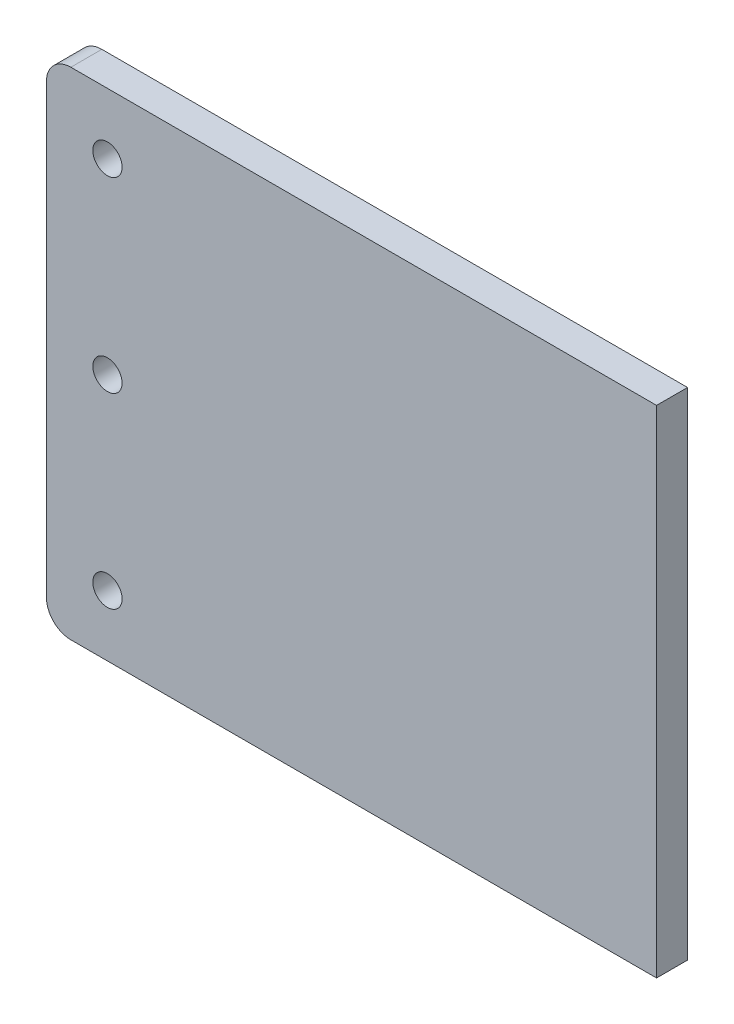
ISO-10303-21;
HEADER;
FILE_DESCRIPTION(('STEP AP214'),'2;1');
FILE_NAME('part.step','',(''),(''),'','','');
FILE_SCHEMA(('AUTOMOTIVE_DESIGN { 1 0 10303 214 1 1 1 1 }'));
ENDSEC;
DATA;
#1=APPLICATION_CONTEXT('core data for automotive mechanical design processes');
#2=APPLICATION_PROTOCOL_DEFINITION('international standard','automotive_design',2000,#1);
#3=PRODUCT_CONTEXT('',#1,'mechanical');
#4=PRODUCT('Part','Part','',(#3));
#5=PRODUCT_RELATED_PRODUCT_CATEGORY('part','',(#4));
#6=PRODUCT_DEFINITION_FORMATION('','',#4);
#7=PRODUCT_DEFINITION_CONTEXT('part definition',#1,'design');
#8=PRODUCT_DEFINITION('design','',#6,#7);
#9=PRODUCT_DEFINITION_SHAPE('','',#8);
#10=(LENGTH_UNIT() NAMED_UNIT(*) SI_UNIT(.MILLI.,.METRE.));
#11=(NAMED_UNIT(*) PLANE_ANGLE_UNIT() SI_UNIT($,.RADIAN.));
#12=(NAMED_UNIT(*) SI_UNIT($,.STERADIAN.) SOLID_ANGLE_UNIT());
#13=UNCERTAINTY_MEASURE_WITH_UNIT(LENGTH_MEASURE(1.E-05),#10,'distance_accuracy_value','');
#14=(GEOMETRIC_REPRESENTATION_CONTEXT(3) GLOBAL_UNCERTAINTY_ASSIGNED_CONTEXT((#13)) GLOBAL_UNIT_ASSIGNED_CONTEXT((#10,
#11,#12)) REPRESENTATION_CONTEXT('',''));
#15=CARTESIAN_POINT('',(0.,0.,0.));
#16=DIRECTION('',(0.,0.,1.));
#17=DIRECTION('',(1.,0.,0.));
#18=AXIS2_PLACEMENT_3D('',#15,#16,#17);
#19=CARTESIAN_POINT('',(50.01,203.6,-127.004202423773));
#20=DIRECTION('',(0.,0.,-1.));
#21=DIRECTION('',(1.,0.,0.));
#22=AXIS2_PLACEMENT_3D('',#19,#20,#21);
#23=PLANE('',#22);
#24=DIRECTION('',(-1.,0.,0.));
#25=VECTOR('',#24,1.);
#26=CARTESIAN_POINT('',(50.01,102.,-127.004202423773));
#27=LINE('',#26,#25);
#28=CARTESIAN_POINT('',(50.,102.,-127.004202423773));
#29=VERTEX_POINT('',#28);
#30=CARTESIAN_POINT('',(-70.,102.,-127.004202423773));
#31=VERTEX_POINT('',#30);
#32=EDGE_CURVE('E11',#29,#31,#27,.T.);
#33=ORIENTED_EDGE('',*,*,#32,.T.);
#34=CARTESIAN_POINT('',(-70.,107.,-127.004202423773));
#35=DIRECTION('',(0.,0.,-1.));
#36=DIRECTION('',(0.,-1.,0.));
#37=AXIS2_PLACEMENT_3D('',#34,#35,#36);
#38=CIRCLE('',#37,5.);
#39=CARTESIAN_POINT('',(-75.,107.,-127.004202423773));
#40=VERTEX_POINT('',#39);
#41=EDGE_CURVE('E127',#40,#31,#38,.F.);
#42=ORIENTED_EDGE('',*,*,#41,.F.);
#43=DIRECTION('',(0.,1.,0.));
#44=VECTOR('',#43,1.);
#45=CARTESIAN_POINT('',(-75.,203.6,-127.004202423773));
#46=LINE('',#45,#44);
#47=CARTESIAN_POINT('',(-75.,198.6,-127.004202423773));
#48=VERTEX_POINT('',#47);
#49=EDGE_CURVE('E103',#40,#48,#46,.T.);
#50=ORIENTED_EDGE('',*,*,#49,.T.);
#51=CARTESIAN_POINT('',(-70.,198.6,-127.004202423773));
#52=DIRECTION('',(0.,0.,-1.));
#53=DIRECTION('',(0.,-1.,0.));
#54=AXIS2_PLACEMENT_3D('',#51,#52,#53);
#55=CIRCLE('',#54,5.);
#56=CARTESIAN_POINT('',(-70.,203.6,-127.004202423773));
#57=VERTEX_POINT('',#56);
#58=EDGE_CURVE('E130',#57,#48,#55,.F.);
#59=ORIENTED_EDGE('',*,*,#58,.F.);
#60=DIRECTION('',(1.,0.,0.));
#61=VECTOR('',#60,1.);
#62=CARTESIAN_POINT('',(-50.,203.6,-127.004202423773));
#63=LINE('',#62,#61);
#64=CARTESIAN_POINT('',(50.,203.6,-127.004202423773));
#65=VERTEX_POINT('',#64);
#66=EDGE_CURVE('E102',#57,#65,#63,.T.);
#67=ORIENTED_EDGE('',*,*,#66,.T.);
#68=DIRECTION('',(0.,-1.,0.));
#69=VECTOR('',#68,1.);
#70=CARTESIAN_POINT('',(50.,0.,-127.004202423773));
#71=LINE('',#70,#69);
#72=EDGE_CURVE('E38',#65,#29,#71,.T.);
#73=ORIENTED_EDGE('',*,*,#72,.T.);
#74=EDGE_LOOP('',(#33,#42,#50,#59,#67,#73));
#75=FACE_BOUND('',#74,.T.);
#76=CARTESIAN_POINT('',(-62.5,114.5,-127.004202423773));
#77=DIRECTION('',(0.,0.,-1.));
#78=DIRECTION('',(0.,-1.,0.));
#79=AXIS2_PLACEMENT_3D('',#76,#77,#78);
#80=CIRCLE('',#79,3.00000000000001);
#81=CARTESIAN_POINT('',(-62.5,111.5,-127.004202423773));
#82=VERTEX_POINT('',#81);
#83=EDGE_CURVE('E110',#82,#82,#80,.T.);
#84=ORIENTED_EDGE('',*,*,#83,.F.);
#85=EDGE_LOOP('',(#84));
#86=FACE_BOUND('',#85,.T.);
#87=CARTESIAN_POINT('',(-62.5,191.1,-127.004202423773));
#88=DIRECTION('',(0.,0.,-1.));
#89=DIRECTION('',(0.,-1.,0.));
#90=AXIS2_PLACEMENT_3D('',#87,#88,#89);
#91=CIRCLE('',#90,3.00000000000001);
#92=CARTESIAN_POINT('',(-62.5,188.1,-127.004202423773));
#93=VERTEX_POINT('',#92);
#94=EDGE_CURVE('E115',#93,#93,#91,.T.);
#95=ORIENTED_EDGE('',*,*,#94,.F.);
#96=EDGE_LOOP('',(#95));
#97=FACE_BOUND('',#96,.T.);
#98=CARTESIAN_POINT('',(-62.5,152.8,-127.004202423773));
#99=DIRECTION('',(0.,0.,-1.));
#100=DIRECTION('',(0.,-1.,0.));
#101=AXIS2_PLACEMENT_3D('',#98,#99,#100);
#102=CIRCLE('',#101,3.00000000000001);
#103=CARTESIAN_POINT('',(-62.5,149.8,-127.004202423773));
#104=VERTEX_POINT('',#103);
#105=EDGE_CURVE('E107',#104,#104,#102,.T.);
#106=ORIENTED_EDGE('',*,*,#105,.F.);
#107=EDGE_LOOP('',(#106));
#108=FACE_BOUND('',#107,.T.);
#109=ADVANCED_FACE('F34',(#75,#86,#97,#108),#23,.T.);
#110=CARTESIAN_POINT('',(50.01,102.,-38.1042024237733));
#111=DIRECTION('',(0.,-1.,0.));
#112=DIRECTION('',(0.,0.,-1.));
#113=AXIS2_PLACEMENT_3D('',#110,#111,#112);
#114=PLANE('',#113);
#115=DIRECTION('',(0.,0.,1.));
#116=VECTOR('',#115,1.);
#117=CARTESIAN_POINT('',(50.,102.,0.));
#118=LINE('',#117,#116);
#119=CARTESIAN_POINT('',(50.,102.,-120.654202423773));
#120=VERTEX_POINT('',#119);
#121=EDGE_CURVE('E92',#29,#120,#118,.T.);
#122=ORIENTED_EDGE('',*,*,#121,.T.);
#123=DIRECTION('',(1.,0.,0.));
#124=VECTOR('',#123,1.);
#125=CARTESIAN_POINT('',(-75.,102.,-120.654202423773));
#126=LINE('',#125,#124);
#127=CARTESIAN_POINT('',(-70.,102.,-120.654202423773));
#128=VERTEX_POINT('',#127);
#129=EDGE_CURVE('E99',#128,#120,#126,.T.);
#130=ORIENTED_EDGE('',*,*,#129,.F.);
#131=DIRECTION('',(0.,0.,-1.));
#132=VECTOR('',#131,1.);
#133=CARTESIAN_POINT('',(-70.,102.,-120.654202423773));
#134=LINE('',#133,#132);
#135=EDGE_CURVE('E125',#31,#128,#134,.F.);
#136=ORIENTED_EDGE('',*,*,#135,.F.);
#137=ORIENTED_EDGE('',*,*,#32,.F.);
#138=EDGE_LOOP('',(#122,#130,#136,#137));
#139=FACE_BOUND('',#138,.T.);
#140=ADVANCED_FACE('F106',(#139),#114,.T.);
#141=CARTESIAN_POINT('',(50.,0.,0.));
#142=DIRECTION('',(1.,0.,0.));
#143=DIRECTION('',(0.,0.,1.));
#144=AXIS2_PLACEMENT_3D('',#141,#142,#143);
#145=PLANE('',#144);
#146=ORIENTED_EDGE('',*,*,#72,.F.);
#147=DIRECTION('',(0.,0.,1.));
#148=VECTOR('',#147,1.);
#149=CARTESIAN_POINT('',(50.,203.6,-120.654202423773));
#150=LINE('',#149,#148);
#151=CARTESIAN_POINT('',(50.,203.6,-120.654202423773));
#152=VERTEX_POINT('',#151);
#153=EDGE_CURVE('E94',#65,#152,#150,.T.);
#154=ORIENTED_EDGE('',*,*,#153,.T.);
#155=DIRECTION('',(0.,-1.,0.));
#156=VECTOR('',#155,1.);
#157=CARTESIAN_POINT('',(50.,102.,-120.654202423773));
#158=LINE('',#157,#156);
#159=EDGE_CURVE('E89',#152,#120,#158,.T.);
#160=ORIENTED_EDGE('',*,*,#159,.T.);
#161=ORIENTED_EDGE('',*,*,#121,.F.);
#162=EDGE_LOOP('',(#146,#154,#160,#161));
#163=FACE_BOUND('',#162,.T.);
#164=ADVANCED_FACE('F36',(#163),#145,.T.);
#165=CARTESIAN_POINT('',(-75.,0.,0.));
#166=DIRECTION('',(-1.,0.,0.));
#167=DIRECTION('',(0.,0.,-1.));
#168=AXIS2_PLACEMENT_3D('',#165,#166,#167);
#169=PLANE('',#168);
#170=DIRECTION('',(0.,-1.,0.));
#171=VECTOR('',#170,1.);
#172=CARTESIAN_POINT('',(-75.,203.6,-120.654202423773));
#173=LINE('',#172,#171);
#174=CARTESIAN_POINT('',(-75.,198.6,-120.654202423773));
#175=VERTEX_POINT('',#174);
#176=CARTESIAN_POINT('',(-75.,107.,-120.654202423773));
#177=VERTEX_POINT('',#176);
#178=EDGE_CURVE('E143',#175,#177,#173,.T.);
#179=ORIENTED_EDGE('',*,*,#178,.F.);
#180=DIRECTION('',(0.,0.,1.));
#181=VECTOR('',#180,1.);
#182=CARTESIAN_POINT('',(-75.,198.6,-120.654202423773));
#183=LINE('',#182,#181);
#184=EDGE_CURVE('E135',#48,#175,#183,.T.);
#185=ORIENTED_EDGE('',*,*,#184,.F.);
#186=ORIENTED_EDGE('',*,*,#49,.F.);
#187=DIRECTION('',(0.,0.,-1.));
#188=VECTOR('',#187,1.);
#189=CARTESIAN_POINT('',(-75.,107.,-127.004202423773));
#190=LINE('',#189,#188);
#191=EDGE_CURVE('E133',#177,#40,#190,.T.);
#192=ORIENTED_EDGE('',*,*,#191,.F.);
#193=EDGE_LOOP('',(#179,#185,#186,#192));
#194=FACE_BOUND('',#193,.T.);
#195=ADVANCED_FACE('F156',(#194),#169,.T.);
#196=CARTESIAN_POINT('',(-50.,102.,-120.654202423773));
#197=DIRECTION('',(0.,0.,-1.));
#198=DIRECTION('',(1.,0.,0.));
#199=AXIS2_PLACEMENT_3D('',#196,#197,#198);
#200=PLANE('',#199);
#201=CARTESIAN_POINT('',(-62.5,114.5,-120.654202423773));
#202=DIRECTION('',(0.,0.,1.));
#203=DIRECTION('',(1.,0.,0.));
#204=AXIS2_PLACEMENT_3D('',#201,#202,#203);
#205=CIRCLE('',#204,3.00000000000001);
#206=CARTESIAN_POINT('',(-59.5,114.5,-120.654202423773));
#207=VERTEX_POINT('',#206);
#208=EDGE_CURVE('E113',#207,#207,#205,.T.);
#209=ORIENTED_EDGE('',*,*,#208,.F.);
#210=EDGE_LOOP('',(#209));
#211=FACE_BOUND('',#210,.T.);
#212=CARTESIAN_POINT('',(-62.5,191.1,-120.654202423773));
#213=DIRECTION('',(0.,0.,1.));
#214=DIRECTION('',(1.,0.,0.));
#215=AXIS2_PLACEMENT_3D('',#212,#213,#214);
#216=CIRCLE('',#215,3.00000000000001);
#217=CARTESIAN_POINT('',(-59.5,191.1,-120.654202423773));
#218=VERTEX_POINT('',#217);
#219=EDGE_CURVE('E114',#218,#218,#216,.T.);
#220=ORIENTED_EDGE('',*,*,#219,.F.);
#221=EDGE_LOOP('',(#220));
#222=FACE_BOUND('',#221,.T.);
#223=CARTESIAN_POINT('',(-62.5,152.8,-120.654202423773));
#224=DIRECTION('',(0.,0.,1.));
#225=DIRECTION('',(1.,0.,0.));
#226=AXIS2_PLACEMENT_3D('',#223,#224,#225);
#227=CIRCLE('',#226,3.00000000000001);
#228=CARTESIAN_POINT('',(-59.5,152.8,-120.654202423773));
#229=VERTEX_POINT('',#228);
#230=EDGE_CURVE('E118',#229,#229,#227,.T.);
#231=ORIENTED_EDGE('',*,*,#230,.F.);
#232=EDGE_LOOP('',(#231));
#233=FACE_BOUND('',#232,.T.);
#234=ORIENTED_EDGE('',*,*,#129,.T.);
#235=ORIENTED_EDGE('',*,*,#159,.F.);
#236=DIRECTION('',(1.,0.,0.));
#237=VECTOR('',#236,1.);
#238=CARTESIAN_POINT('',(-50.,203.6,-120.654202423773));
#239=LINE('',#238,#237);
#240=CARTESIAN_POINT('',(-70.,203.6,-120.654202423773));
#241=VERTEX_POINT('',#240);
#242=EDGE_CURVE('E96',#241,#152,#239,.T.);
#243=ORIENTED_EDGE('',*,*,#242,.F.);
#244=CARTESIAN_POINT('',(-70.,198.6,-120.654202423773));
#245=DIRECTION('',(0.,0.,1.));
#246=DIRECTION('',(1.,0.,0.));
#247=AXIS2_PLACEMENT_3D('',#244,#245,#246);
#248=CIRCLE('',#247,5.);
#249=EDGE_CURVE('E123',#175,#241,#248,.F.);
#250=ORIENTED_EDGE('',*,*,#249,.F.);
#251=ORIENTED_EDGE('',*,*,#178,.T.);
#252=CARTESIAN_POINT('',(-70.,107.,-120.654202423773));
#253=DIRECTION('',(0.,0.,1.));
#254=DIRECTION('',(1.,0.,0.));
#255=AXIS2_PLACEMENT_3D('',#252,#253,#254);
#256=CIRCLE('',#255,5.);
#257=EDGE_CURVE('E58',#128,#177,#256,.F.);
#258=ORIENTED_EDGE('',*,*,#257,.F.);
#259=EDGE_LOOP('',(#234,#235,#243,#250,#251,#258));
#260=FACE_BOUND('',#259,.T.);
#261=ADVANCED_FACE('F100',(#211,#222,#233,#260),#200,.F.);
#262=CARTESIAN_POINT('',(-62.5,114.5,-143.154202423773));
#263=DIRECTION('',(0.,0.,1.));
#264=DIRECTION('',(-1.,0.,0.));
#265=AXIS2_PLACEMENT_3D('',#262,#263,#264);
#266=CYLINDRICAL_SURFACE('',#265,3.00000000000001);
#267=ORIENTED_EDGE('',*,*,#83,.T.);
#268=EDGE_LOOP('',(#267));
#269=FACE_BOUND('',#268,.T.);
#270=ORIENTED_EDGE('',*,*,#208,.T.);
#271=EDGE_LOOP('',(#270));
#272=FACE_BOUND('',#271,.T.);
#273=ADVANCED_FACE('F155',(#269,#272),#266,.F.);
#274=CARTESIAN_POINT('',(-62.5,191.1,-143.154202423773));
#275=DIRECTION('',(0.,0.,1.));
#276=DIRECTION('',(-1.,0.,0.));
#277=AXIS2_PLACEMENT_3D('',#274,#275,#276);
#278=CYLINDRICAL_SURFACE('',#277,3.00000000000001);
#279=ORIENTED_EDGE('',*,*,#94,.T.);
#280=EDGE_LOOP('',(#279));
#281=FACE_BOUND('',#280,.T.);
#282=ORIENTED_EDGE('',*,*,#219,.T.);
#283=EDGE_LOOP('',(#282));
#284=FACE_BOUND('',#283,.T.);
#285=ADVANCED_FACE('F163',(#281,#284),#278,.F.);
#286=CARTESIAN_POINT('',(-62.5,152.8,-143.154202423773));
#287=DIRECTION('',(0.,0.,1.));
#288=DIRECTION('',(-1.,0.,0.));
#289=AXIS2_PLACEMENT_3D('',#286,#287,#288);
#290=CYLINDRICAL_SURFACE('',#289,3.00000000000001);
#291=ORIENTED_EDGE('',*,*,#105,.T.);
#292=EDGE_LOOP('',(#291));
#293=FACE_BOUND('',#292,.T.);
#294=ORIENTED_EDGE('',*,*,#230,.T.);
#295=EDGE_LOOP('',(#294));
#296=FACE_BOUND('',#295,.T.);
#297=ADVANCED_FACE('F152',(#293,#296),#290,.F.);
#298=CARTESIAN_POINT('',(-70.,198.6,0.));
#299=DIRECTION('',(0.,0.,-1.));
#300=DIRECTION('',(1.,0.,0.));
#301=AXIS2_PLACEMENT_3D('',#298,#299,#300);
#302=CYLINDRICAL_SURFACE('',#301,5.);
#303=ORIENTED_EDGE('',*,*,#58,.T.);
#304=ORIENTED_EDGE('',*,*,#184,.T.);
#305=ORIENTED_EDGE('',*,*,#249,.T.);
#306=DIRECTION('',(0.,0.,1.));
#307=VECTOR('',#306,1.);
#308=CARTESIAN_POINT('',(-70.,203.6,-127.004202423773));
#309=LINE('',#308,#307);
#310=EDGE_CURVE('E43',#241,#57,#309,.F.);
#311=ORIENTED_EDGE('',*,*,#310,.T.);
#312=EDGE_LOOP('',(#303,#304,#305,#311));
#313=FACE_BOUND('',#312,.T.);
#314=ADVANCED_FACE('F186',(#313),#302,.T.);
#315=CARTESIAN_POINT('',(-70.,107.,-2.33846188257661E-13));
#316=DIRECTION('',(0.,0.,1.));
#317=DIRECTION('',(0.,-1.,0.));
#318=AXIS2_PLACEMENT_3D('',#315,#316,#317);
#319=CYLINDRICAL_SURFACE('',#318,5.);
#320=ORIENTED_EDGE('',*,*,#257,.T.);
#321=ORIENTED_EDGE('',*,*,#191,.T.);
#322=ORIENTED_EDGE('',*,*,#41,.T.);
#323=ORIENTED_EDGE('',*,*,#135,.T.);
#324=EDGE_LOOP('',(#320,#321,#322,#323));
#325=FACE_BOUND('',#324,.T.);
#326=ADVANCED_FACE('F182',(#325),#319,.T.);
#327=CARTESIAN_POINT('',(-50.,203.6,-120.654202423773));
#328=DIRECTION('',(0.,-1.,0.));
#329=DIRECTION('',(0.,0.,-1.));
#330=AXIS2_PLACEMENT_3D('',#327,#328,#329);
#331=PLANE('',#330);
#332=ORIENTED_EDGE('',*,*,#66,.F.);
#333=ORIENTED_EDGE('',*,*,#310,.F.);
#334=ORIENTED_EDGE('',*,*,#242,.T.);
#335=ORIENTED_EDGE('',*,*,#153,.F.);
#336=EDGE_LOOP('',(#332,#333,#334,#335));
#337=FACE_BOUND('',#336,.T.);
#338=ADVANCED_FACE('F180',(#337),#331,.F.);
#339=CLOSED_SHELL('',(#109,#140,#164,#195,#261,#273,#285,#297,#314,#326,#338));
#340=MANIFOLD_SOLID_BREP('B2',#339);
#341=ADVANCED_BREP_SHAPE_REPRESENTATION('',(#18,#340),#14);
#342=SHAPE_DEFINITION_REPRESENTATION(#9,#341);
ENDSEC;
END-ISO-10303-21;
